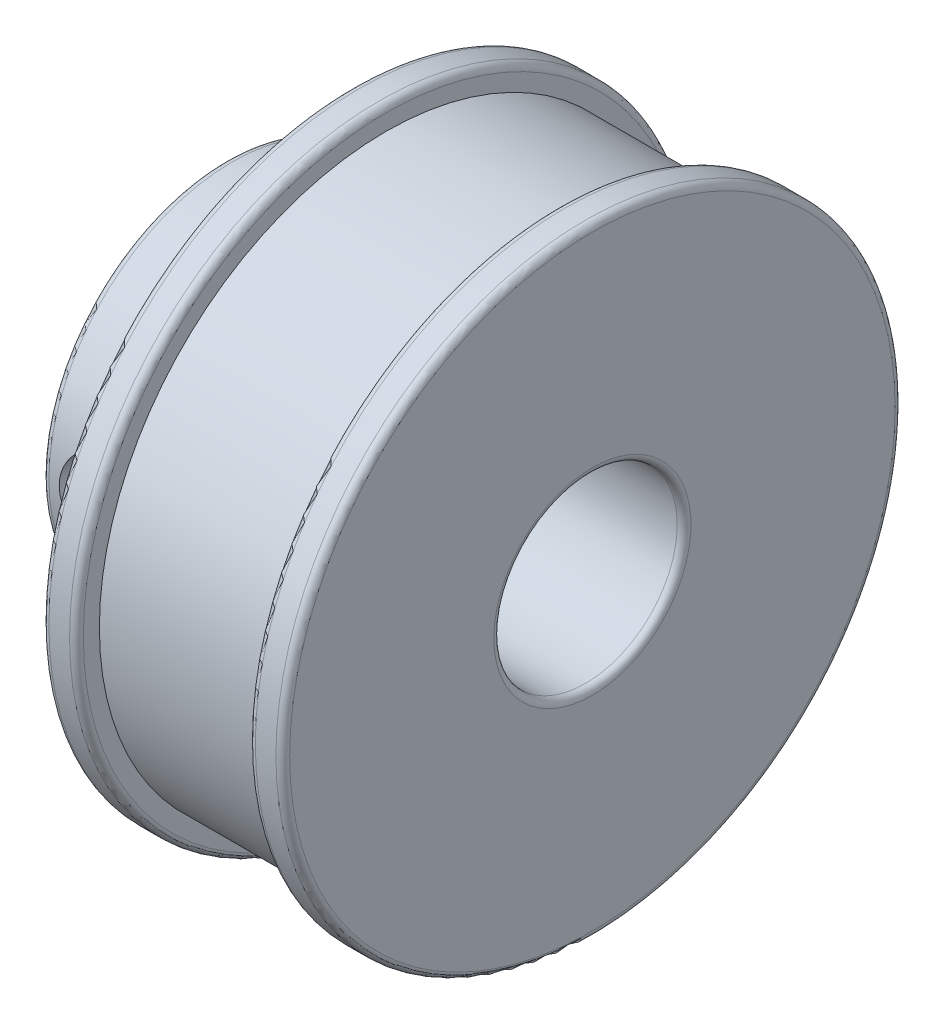
ISO-10303-21;
HEADER;
FILE_DESCRIPTION(('STEP AP214'),'2;1');
FILE_NAME('part.step','',(''),(''),'','','');
FILE_SCHEMA(('AUTOMOTIVE_DESIGN { 1 0 10303 214 1 1 1 1 }'));
ENDSEC;
DATA;
#1=APPLICATION_CONTEXT('core data for automotive mechanical design processes');
#2=APPLICATION_PROTOCOL_DEFINITION('international standard','automotive_design',2000,#1);
#3=PRODUCT_CONTEXT('',#1,'mechanical');
#4=PRODUCT('Part','Part','',(#3));
#5=PRODUCT_RELATED_PRODUCT_CATEGORY('part','',(#4));
#6=PRODUCT_DEFINITION_FORMATION('','',#4);
#7=PRODUCT_DEFINITION_CONTEXT('part definition',#1,'design');
#8=PRODUCT_DEFINITION('design','',#6,#7);
#9=PRODUCT_DEFINITION_SHAPE('','',#8);
#10=(LENGTH_UNIT() NAMED_UNIT(*) SI_UNIT(.MILLI.,.METRE.));
#11=(NAMED_UNIT(*) PLANE_ANGLE_UNIT() SI_UNIT($,.RADIAN.));
#12=(NAMED_UNIT(*) SI_UNIT($,.STERADIAN.) SOLID_ANGLE_UNIT());
#13=UNCERTAINTY_MEASURE_WITH_UNIT(LENGTH_MEASURE(1.E-05),#10,'distance_accuracy_value','');
#14=(GEOMETRIC_REPRESENTATION_CONTEXT(3) GLOBAL_UNCERTAINTY_ASSIGNED_CONTEXT((#13)) GLOBAL_UNIT_ASSIGNED_CONTEXT((#10,
#11,#12)) REPRESENTATION_CONTEXT('',''));
#15=CARTESIAN_POINT('',(0.,0.,0.));
#16=DIRECTION('',(0.,0.,1.));
#17=DIRECTION('',(1.,0.,0.));
#18=AXIS2_PLACEMENT_3D('',#15,#16,#17);
#19=CARTESIAN_POINT('',(0.,0.,0.));
#20=DIRECTION('',(-1.,0.,0.));
#21=DIRECTION('',(0.,0.,1.));
#22=AXIS2_PLACEMENT_3D('',#19,#20,#21);
#23=CYLINDRICAL_SURFACE('',#22,4.);
#24=CARTESIAN_POINT('',(4.75,0.,4.));
#25=CARTESIAN_POINT('',(4.74999339536562,0.105143925902467,3.99999426810083));
#26=CARTESIAN_POINT('',(4.74165985375789,0.210413199395125,3.99580982039513));
#27=CARTESIAN_POINT('',(4.70869423931693,0.417840470537792,3.97948312074314));
#28=CARTESIAN_POINT('',(4.68403121400437,0.519992173427259,3.96732575657839));
#29=CARTESIAN_POINT('',(4.61961238276674,0.717867089760898,3.93632558806751));
#30=CARTESIAN_POINT('',(4.57991523150407,0.813613605878293,3.91750878355075));
#31=CARTESIAN_POINT('',(4.48685875727003,0.996945233613198,3.87491553031523));
#32=CARTESIAN_POINT('',(4.43350051150227,1.08453098798012,3.85113947267051));
#33=CARTESIAN_POINT('',(4.31096550102943,1.25501563552382,3.79912516516124));
#34=CARTESIAN_POINT('',(4.24102704152072,1.33731042224422,3.77070398255074));
#35=CARTESIAN_POINT('',(4.08895704150593,1.48955888973396,3.71319940493486));
#36=CARTESIAN_POINT('',(4.00681629645512,1.55950316621354,3.68411552418069));
#37=CARTESIAN_POINT('',(3.82503330095324,1.69050400090056,3.62597902394695));
#38=CARTESIAN_POINT('',(3.72452780330818,1.75045067110327,3.59710373940264));
#39=CARTESIAN_POINT('',(3.51326532802757,1.85233645378139,3.54571957544641));
#40=CARTESIAN_POINT('',(3.4025157425545,1.89428842993267,3.52320615213979));
#41=CARTESIAN_POINT('',(3.18066978915616,1.95626488437718,3.48915734075617));
#42=CARTESIAN_POINT('',(3.06999109586521,1.97745171416088,3.47704543167427));
#43=CARTESIAN_POINT('',(2.84604232444105,2.00085398661769,3.46363779897055));
#44=CARTESIAN_POINT('',(2.73277491825769,2.00308817674615,3.46233138686576));
#45=CARTESIAN_POINT('',(2.52142795136926,1.98937457434459,3.47021860514497));
#46=CARTESIAN_POINT('',(2.4231519375539,1.97556911907364,3.47817527324027));
#47=CARTESIAN_POINT('',(2.23055618125392,1.93387969811387,3.50152457467701));
#48=CARTESIAN_POINT('',(2.13623770938937,1.9059912477953,3.51691957663553));
#49=CARTESIAN_POINT('',(1.95154173486868,1.83641956077201,3.55374952825482));
#50=CARTESIAN_POINT('',(1.86130720242842,1.79443013423199,3.57531681327997));
#51=CARTESIAN_POINT('',(1.68873141481998,1.69808337533601,3.62206808562807));
#52=CARTESIAN_POINT('',(1.60639372879982,1.64372048762494,3.64725369560381));
#53=CARTESIAN_POINT('',(1.44095749451355,1.51613210982558,3.70226315806572));
#54=CARTESIAN_POINT('',(1.35908625284769,1.44138891673856,3.73227020473492));
#55=CARTESIAN_POINT('',(1.2085291628182,1.27911115748275,3.79095246600815));
#56=CARTESIAN_POINT('',(1.13984961593223,1.19157051314857,3.81962703917602));
#57=CARTESIAN_POINT('',(1.01462867794055,1.0010330116637,3.87403974565928));
#58=CARTESIAN_POINT('',(0.958799055108519,0.897507183198818,3.89957968324015));
#59=CARTESIAN_POINT('',(0.865805941913981,0.680932430977594,3.94315762242485));
#60=CARTESIAN_POINT('',(0.828627629969667,0.567891152530552,3.96120157887106));
#61=CARTESIAN_POINT('',(0.777049192566646,0.345532983321405,3.98648667482871));
#62=CARTESIAN_POINT('',(0.761017528506437,0.236683061096652,3.9944987660262));
#63=CARTESIAN_POINT('',(0.747070537731025,0.0175591998987032,4.00146026918207));
#64=CARTESIAN_POINT('',(0.749146628721063,-0.0927140397398174,4.00041397442638));
#65=CARTESIAN_POINT('',(0.770413376837487,-0.302465943971974,3.9898238450687));
#66=CARTESIAN_POINT('',(0.788265065459988,-0.402118816099861,3.98094491376337));
#67=CARTESIAN_POINT('',(0.838476143790243,-0.596813784603883,3.95644342629681));
#68=CARTESIAN_POINT('',(0.870837132906987,-0.691855371382174,3.94082012668824));
#69=CARTESIAN_POINT('',(0.949996932866066,-0.877777216899146,3.90368502827176));
#70=CARTESIAN_POINT('',(0.997182100232574,-0.968460794011607,3.88201763539262));
#71=CARTESIAN_POINT('',(1.10421507129313,-1.14092272339854,3.83487948634835));
#72=CARTESIAN_POINT('',(1.16406826919079,-1.22269725955318,3.80940711133877));
#73=CARTESIAN_POINT('',(1.30152085066143,-1.38353537857843,3.75416442672396));
#74=CARTESIAN_POINT('',(1.38028573689029,-1.46154415563805,3.72421769686999));
#75=CARTESIAN_POINT('',(1.54985030255546,-1.60371264223771,3.6652478321764));
#76=CARTESIAN_POINT('',(1.64065823769584,-1.66786277142375,3.63622534800094));
#77=CARTESIAN_POINT('',(1.83728730834595,-1.78341582895804,3.58102384412979));
#78=CARTESIAN_POINT('',(1.94362253218896,-1.8340509916005,3.55505059178122));
#79=CARTESIAN_POINT('',(2.16502013514993,-1.91616565186941,3.5114814458827));
#80=CARTESIAN_POINT('',(2.28007105293378,-1.94766983173403,3.493874764435));
#81=CARTESIAN_POINT('',(2.50382044576941,-1.98772337493375,3.47123002051604));
#82=CARTESIAN_POINT('',(2.61206850687048,-1.9981859928109,3.4651476693013));
#83=CARTESIAN_POINT('',(2.82889413432905,-2.00137830875241,3.46330709283207));
#84=CARTESIAN_POINT('',(2.93747153747572,-1.99411569324648,3.4675443925278));
#85=CARTESIAN_POINT('',(3.14096700306687,-1.96385225118662,3.48475724102153));
#86=CARTESIAN_POINT('',(3.23620094028948,-1.94241662868607,3.49686188965317));
#87=CARTESIAN_POINT('',(3.42161623884873,-1.88635071644882,3.52742032375305));
#88=CARTESIAN_POINT('',(3.51179596418406,-1.85171618231984,3.54587615139337));
#89=CARTESIAN_POINT('',(3.69124970197307,-1.76763149060113,3.58857060729071));
#90=CARTESIAN_POINT('',(3.78005580365806,-1.7173422756314,3.61311444791841));
#91=CARTESIAN_POINT('',(3.94854907236252,-1.60430194327479,3.66470663269721));
#92=CARTESIAN_POINT('',(4.02823146104222,-1.54154434248312,3.69175627591221));
#93=CARTESIAN_POINT('',(4.18628396470935,-1.39640665332275,3.74924646316184));
#94=CARTESIAN_POINT('',(4.26331820470058,-1.31256884599452,3.77969966613256));
#95=CARTESIAN_POINT('',(4.40252596687054,-1.1323096124664,3.83755504519862));
#96=CARTESIAN_POINT('',(4.46469147893981,-1.0358814466104,3.8649555725239));
#97=CARTESIAN_POINT('',(4.57247272542414,-0.831863193565893,3.91396019133075));
#98=CARTESIAN_POINT('',(4.61796833847294,-0.724199007553463,3.93552192987866));
#99=CARTESIAN_POINT('',(4.68961633551482,-0.501484202276175,3.97002682597974));
#100=CARTESIAN_POINT('',(4.71582369361143,-0.386455599178201,3.98299446726136));
#101=CARTESIAN_POINT('',(4.73779482217148,-0.225203892981791,3.99390923826956));
#102=CARTESIAN_POINT('',(4.74236528173268,-0.18032375888313,3.99618730680502));
#103=CARTESIAN_POINT('',(4.74846933102817,-0.0903034636101834,3.99923393953631));
#104=CARTESIAN_POINT('',(4.75000283694042,-0.045163295293257,4.00000246206762));
#105=CARTESIAN_POINT('',(4.75,0.,4.));
#106=B_SPLINE_CURVE_WITH_KNOTS('',3,(#24,#25,#26,#27,#28,#29,#30,#31,#32,#33,#34,#35,#36,#37,
#38,#39,#40,#41,#42,#43,#44,#45,#46,#47,#48,#49,#50,#51,#52,#53,#54,#55,#56,#57,#58,#59,#60,#61,
#62,#63,#64,#65,#66,#67,#68,#69,#70,#71,#72,#73,#74,#75,#76,#77,#78,#79,#80,#81,#82,#83,#84,#85,
#86,#87,#88,#89,#90,#91,#92,#93,#94,#95,#96,#97,#98,#99,#100,#101,#102,#103,#104,#105),
.UNSPECIFIED.,.T.,.F.,(4,2,2,2,2,2,2,2,2,2,2,2,2,2,2,2,2,2,2,2,2,2,2,2,2,2,2,2,2,2,2,2,2,2,2,2,
2,2,2,2,4),(0.,0.315248514840585,0.631096299418396,0.945724310984597,1.26032752116314,
1.59396351743618,1.92785247530807,2.28763452861506,2.64715895796562,2.98516024280459,
3.32282714658041,3.62011424818641,3.91749607851357,4.22180480336975,4.52625042520444,
4.86929882667757,5.21251069197373,5.57166044428881,5.93052433824559,6.25966580942691,
6.58865129022952,6.89213813012244,7.19565843261863,7.50785712055797,7.82018901496679,
8.16319221288838,8.50643177230864,8.86629364323452,9.22569023890902,9.55058615006093,
9.87534119729357,10.1691586049771,10.463070575767,10.7767291356057,11.0905512228726,
11.4425048551434,11.7946476676249,12.1492802732705,12.502898172423,12.6383056026783,
12.7737167702213),.UNSPECIFIED.);
#107=CARTESIAN_POINT('',(4.75,0.,4.));
#108=VERTEX_POINT('',#107);
#109=EDGE_CURVE('E90',#108,#108,#106,.T.);
#110=ORIENTED_EDGE('',*,*,#109,.T.);
#111=EDGE_LOOP('',(#110));
#112=FACE_BOUND('',#111,.T.);
#113=CARTESIAN_POINT('',(4.75,0.,-4.));
#114=CARTESIAN_POINT('',(4.74999339536562,-0.105143925902467,-3.99999426810083));
#115=CARTESIAN_POINT('',(4.74165985375789,-0.210413199395125,-3.99580982039513));
#116=CARTESIAN_POINT('',(4.70869423931693,-0.417840470537792,-3.97948312074314));
#117=CARTESIAN_POINT('',(4.68403121400437,-0.519992173427259,-3.96732575657839));
#118=CARTESIAN_POINT('',(4.61961238276674,-0.717867089760898,-3.93632558806751));
#119=CARTESIAN_POINT('',(4.57991523150407,-0.813613605878293,-3.91750878355075));
#120=CARTESIAN_POINT('',(4.48685875727003,-0.996945233613198,-3.87491553031523));
#121=CARTESIAN_POINT('',(4.43350051150227,-1.08453098798012,-3.85113947267051));
#122=CARTESIAN_POINT('',(4.31096550102943,-1.25501563552382,-3.79912516516124));
#123=CARTESIAN_POINT('',(4.24102704152072,-1.33731042224422,-3.77070398255074));
#124=CARTESIAN_POINT('',(4.08895704150593,-1.48955888973396,-3.71319940493486));
#125=CARTESIAN_POINT('',(4.00681629645512,-1.55950316621354,-3.68411552418069));
#126=CARTESIAN_POINT('',(3.82503330095324,-1.69050400090056,-3.62597902394695));
#127=CARTESIAN_POINT('',(3.72452780330818,-1.75045067110327,-3.59710373940264));
#128=CARTESIAN_POINT('',(3.51326532802757,-1.85233645378139,-3.54571957544641));
#129=CARTESIAN_POINT('',(3.4025157425545,-1.89428842993267,-3.52320615213979));
#130=CARTESIAN_POINT('',(3.18066978915616,-1.95626488437718,-3.48915734075617));
#131=CARTESIAN_POINT('',(3.06999109586521,-1.97745171416088,-3.47704543167427));
#132=CARTESIAN_POINT('',(2.84604232444105,-2.00085398661769,-3.46363779897055));
#133=CARTESIAN_POINT('',(2.73277491825769,-2.00308817674615,-3.46233138686576));
#134=CARTESIAN_POINT('',(2.52142795136926,-1.98937457434459,-3.47021860514497));
#135=CARTESIAN_POINT('',(2.4231519375539,-1.97556911907364,-3.47817527324027));
#136=CARTESIAN_POINT('',(2.23055618125392,-1.93387969811387,-3.50152457467701));
#137=CARTESIAN_POINT('',(2.13623770938937,-1.9059912477953,-3.51691957663553));
#138=CARTESIAN_POINT('',(1.95154173486868,-1.83641956077201,-3.55374952825482));
#139=CARTESIAN_POINT('',(1.86130720242842,-1.79443013423199,-3.57531681327997));
#140=CARTESIAN_POINT('',(1.68873141481998,-1.69808337533601,-3.62206808562807));
#141=CARTESIAN_POINT('',(1.60639372879982,-1.64372048762494,-3.64725369560381));
#142=CARTESIAN_POINT('',(1.44095749451355,-1.51613210982558,-3.70226315806572));
#143=CARTESIAN_POINT('',(1.35908625284769,-1.44138891673856,-3.73227020473492));
#144=CARTESIAN_POINT('',(1.2085291628182,-1.27911115748275,-3.79095246600815));
#145=CARTESIAN_POINT('',(1.13984961593223,-1.19157051314857,-3.81962703917602));
#146=CARTESIAN_POINT('',(1.01462867794055,-1.0010330116637,-3.87403974565928));
#147=CARTESIAN_POINT('',(0.958799055108519,-0.897507183198818,-3.89957968324015));
#148=CARTESIAN_POINT('',(0.865805941913981,-0.680932430977594,-3.94315762242485));
#149=CARTESIAN_POINT('',(0.828627629969667,-0.567891152530552,-3.96120157887106));
#150=CARTESIAN_POINT('',(0.777049192566646,-0.345532983321405,-3.98648667482871));
#151=CARTESIAN_POINT('',(0.761017528506437,-0.236683061096652,-3.9944987660262));
#152=CARTESIAN_POINT('',(0.747070537731025,-0.0175591998987032,-4.00146026918207));
#153=CARTESIAN_POINT('',(0.749146628721063,0.0927140397398174,-4.00041397442638));
#154=CARTESIAN_POINT('',(0.770413376837487,0.302465943971974,-3.9898238450687));
#155=CARTESIAN_POINT('',(0.788265065459988,0.402118816099861,-3.98094491376337));
#156=CARTESIAN_POINT('',(0.838476143790243,0.596813784603883,-3.95644342629681));
#157=CARTESIAN_POINT('',(0.870837132906987,0.691855371382174,-3.94082012668824));
#158=CARTESIAN_POINT('',(0.949996932866066,0.877777216899146,-3.90368502827176));
#159=CARTESIAN_POINT('',(0.997182100232574,0.968460794011607,-3.88201763539262));
#160=CARTESIAN_POINT('',(1.10421507129313,1.14092272339854,-3.83487948634835));
#161=CARTESIAN_POINT('',(1.16406826919079,1.22269725955318,-3.80940711133877));
#162=CARTESIAN_POINT('',(1.30152085066143,1.38353537857843,-3.75416442672396));
#163=CARTESIAN_POINT('',(1.38028573689029,1.46154415563805,-3.72421769686999));
#164=CARTESIAN_POINT('',(1.54985030255546,1.60371264223771,-3.6652478321764));
#165=CARTESIAN_POINT('',(1.64065823769584,1.66786277142375,-3.63622534800094));
#166=CARTESIAN_POINT('',(1.83728730834595,1.78341582895804,-3.58102384412979));
#167=CARTESIAN_POINT('',(1.94362253218896,1.8340509916005,-3.55505059178122));
#168=CARTESIAN_POINT('',(2.16502013514993,1.91616565186941,-3.5114814458827));
#169=CARTESIAN_POINT('',(2.28007105293378,1.94766983173403,-3.493874764435));
#170=CARTESIAN_POINT('',(2.50382044576941,1.98772337493375,-3.47123002051604));
#171=CARTESIAN_POINT('',(2.61206850687048,1.9981859928109,-3.4651476693013));
#172=CARTESIAN_POINT('',(2.82889413432905,2.00137830875241,-3.46330709283207));
#173=CARTESIAN_POINT('',(2.93747153747572,1.99411569324648,-3.4675443925278));
#174=CARTESIAN_POINT('',(3.14096700306687,1.96385225118662,-3.48475724102153));
#175=CARTESIAN_POINT('',(3.23620094028948,1.94241662868607,-3.49686188965317));
#176=CARTESIAN_POINT('',(3.42161623884873,1.88635071644882,-3.52742032375305));
#177=CARTESIAN_POINT('',(3.51179596418406,1.85171618231984,-3.54587615139337));
#178=CARTESIAN_POINT('',(3.69124970197307,1.76763149060113,-3.58857060729071));
#179=CARTESIAN_POINT('',(3.78005580365806,1.7173422756314,-3.61311444791841));
#180=CARTESIAN_POINT('',(3.94854907236252,1.60430194327479,-3.66470663269721));
#181=CARTESIAN_POINT('',(4.02823146104222,1.54154434248312,-3.69175627591221));
#182=CARTESIAN_POINT('',(4.18628396470935,1.39640665332275,-3.74924646316184));
#183=CARTESIAN_POINT('',(4.26331820470058,1.31256884599452,-3.77969966613256));
#184=CARTESIAN_POINT('',(4.40252596687054,1.1323096124664,-3.83755504519862));
#185=CARTESIAN_POINT('',(4.46469147893981,1.0358814466104,-3.8649555725239));
#186=CARTESIAN_POINT('',(4.57247272542414,0.831863193565893,-3.91396019133075));
#187=CARTESIAN_POINT('',(4.61796833847294,0.724199007553463,-3.93552192987866));
#188=CARTESIAN_POINT('',(4.68961633551482,0.501484202276175,-3.97002682597974));
#189=CARTESIAN_POINT('',(4.71582369361143,0.386455599178201,-3.98299446726136));
#190=CARTESIAN_POINT('',(4.73779482217148,0.225203892981791,-3.99390923826956));
#191=CARTESIAN_POINT('',(4.74236528173268,0.18032375888313,-3.99618730680502));
#192=CARTESIAN_POINT('',(4.74846933102817,0.0903034636101834,-3.99923393953631));
#193=CARTESIAN_POINT('',(4.75000283694042,0.045163295293257,-4.00000246206762));
#194=CARTESIAN_POINT('',(4.75,0.,-4.));
#195=B_SPLINE_CURVE_WITH_KNOTS('',3,(#113,#114,#115,#116,#117,#118,#119,#120,#121,#122,#123,
#124,#125,#126,#127,#128,#129,#130,#131,#132,#133,#134,#135,#136,#137,#138,#139,#140,#141,#142,
#143,#144,#145,#146,#147,#148,#149,#150,#151,#152,#153,#154,#155,#156,#157,#158,#159,#160,#161,
#162,#163,#164,#165,#166,#167,#168,#169,#170,#171,#172,#173,#174,#175,#176,#177,#178,#179,#180,
#181,#182,#183,#184,#185,#186,#187,#188,#189,#190,#191,#192,#193,#194),.UNSPECIFIED.,.T.,.F.,(4,
2,2,2,2,2,2,2,2,2,2,2,2,2,2,2,2,2,2,2,2,2,2,2,2,2,2,2,2,2,2,2,2,2,2,2,2,2,2,2,4),(0.,
0.315248514840585,0.631096299418396,0.945724310984597,1.26032752116314,1.59396351743618,
1.92785247530807,2.28763452861506,2.64715895796562,2.98516024280459,3.32282714658041,
3.62011424818641,3.91749607851357,4.22180480336975,4.52625042520444,4.86929882667757,
5.21251069197373,5.57166044428881,5.93052433824559,6.25966580942691,6.58865129022952,
6.89213813012244,7.19565843261863,7.50785712055797,7.82018901496679,8.16319221288838,
8.50643177230864,8.86629364323452,9.22569023890902,9.55058615006093,9.87534119729357,
10.1691586049771,10.463070575767,10.7767291356057,11.0905512228726,11.4425048551434,
11.7946476676249,12.1492802732705,12.502898172423,12.6383056026783,12.7737167702213),.UNSPECIFIED.);
#196=CARTESIAN_POINT('',(4.75,0.,-4.));
#197=VERTEX_POINT('',#196);
#198=EDGE_CURVE('E83',#197,#197,#195,.T.);
#199=ORIENTED_EDGE('',*,*,#198,.T.);
#200=EDGE_LOOP('',(#199));
#201=FACE_BOUND('',#200,.T.);
#202=CARTESIAN_POINT('',(0.3,0.,0.));
#203=DIRECTION('',(1.,0.,0.));
#204=DIRECTION('',(0.,0.,-1.));
#205=AXIS2_PLACEMENT_3D('',#202,#203,#204);
#206=CIRCLE('',#205,4.);
#207=CARTESIAN_POINT('',(0.3,0.,-4.));
#208=VERTEX_POINT('',#207);
#209=EDGE_CURVE('E175',#208,#208,#206,.F.);
#210=ORIENTED_EDGE('',*,*,#209,.T.);
#211=EDGE_LOOP('',(#210));
#212=FACE_BOUND('',#211,.T.);
#213=CARTESIAN_POINT('',(15.7,0.,0.));
#214=DIRECTION('',(-1.,0.,0.));
#215=DIRECTION('',(0.,0.,1.));
#216=AXIS2_PLACEMENT_3D('',#213,#214,#215);
#217=CIRCLE('',#216,4.);
#218=CARTESIAN_POINT('',(15.7,0.,4.));
#219=VERTEX_POINT('',#218);
#220=EDGE_CURVE('E171',#219,#219,#217,.F.);
#221=ORIENTED_EDGE('',*,*,#220,.T.);
#222=EDGE_LOOP('',(#221));
#223=FACE_BOUND('',#222,.T.);
#224=ADVANCED_FACE('F37',(#112,#201,#212,#223),#23,.F.);
#225=CARTESIAN_POINT('',(0.,0.,-4.));
#226=DIRECTION('',(1.,0.,0.));
#227=DIRECTION('',(0.,0.,-1.));
#228=AXIS2_PLACEMENT_3D('',#225,#226,#227);
#229=PLANE('',#228);
#230=CARTESIAN_POINT('',(0.,0.,0.));
#231=DIRECTION('',(1.,0.,0.));
#232=DIRECTION('',(0.,0.,-1.));
#233=AXIS2_PLACEMENT_3D('',#230,#231,#232);
#234=CIRCLE('',#233,4.3);
#235=CARTESIAN_POINT('',(0.,0.,-4.3));
#236=VERTEX_POINT('',#235);
#237=EDGE_CURVE('E183',#236,#236,#234,.T.);
#238=ORIENTED_EDGE('',*,*,#237,.T.);
#239=EDGE_LOOP('',(#238));
#240=FACE_BOUND('',#239,.T.);
#241=CARTESIAN_POINT('',(0.,0.,0.));
#242=DIRECTION('',(1.,0.,0.));
#243=DIRECTION('',(0.,0.,-1.));
#244=AXIS2_PLACEMENT_3D('',#241,#242,#243);
#245=CIRCLE('',#244,7.7);
#246=CARTESIAN_POINT('',(0.,0.,-7.7));
#247=VERTEX_POINT('',#246);
#248=EDGE_CURVE('E179',#247,#247,#245,.F.);
#249=ORIENTED_EDGE('',*,*,#248,.T.);
#250=EDGE_LOOP('',(#249));
#251=FACE_BOUND('',#250,.T.);
#252=ADVANCED_FACE('F98',(#240,#251),#229,.F.);
#253=CARTESIAN_POINT('',(0.,0.,0.));
#254=DIRECTION('',(-1.,0.,0.));
#255=DIRECTION('',(0.,0.,1.));
#256=AXIS2_PLACEMENT_3D('',#253,#254,#255);
#257=CYLINDRICAL_SURFACE('',#256,8.);
#258=CARTESIAN_POINT('',(4.75,0.,8.));
#259=CARTESIAN_POINT('',(4.74999689901579,-0.110501451559641,7.9999981315735));
#260=CARTESIAN_POINT('',(4.74081126563495,-0.221037543774351,7.99768770842435));
#261=CARTESIAN_POINT('',(4.70436646492399,-0.438941765027377,7.98869485106526));
#262=CARTESIAN_POINT('',(4.67709705394953,-0.54630806249432,7.98200993893301));
#263=CARTESIAN_POINT('',(4.60541432871722,-0.754694496243436,7.96500835109376));
#264=CARTESIAN_POINT('',(4.56102160171297,-0.855722084573336,7.95469603789411));
#265=CARTESIAN_POINT('',(4.45642481327354,-1.04889617587257,7.93153791743495));
#266=CARTESIAN_POINT('',(4.39622021850804,-1.14104237913168,7.91869202472209));
#267=CARTESIAN_POINT('',(4.26039894712776,-1.31573590306789,7.89156551455591));
#268=CARTESIAN_POINT('',(4.18451790005459,-1.39807425341474,7.87726276197502));
#269=CARTESIAN_POINT('',(4.02006372678795,-1.54899856960443,7.84898160157248));
#270=CARTESIAN_POINT('',(3.93148916940408,-1.61758298259892,7.83500323053157));
#271=CARTESIAN_POINT('',(3.74253969768401,-1.74003539039863,7.80873034264225));
#272=CARTESIAN_POINT('',(3.64200902558836,-1.79366962123352,7.79646392619748));
#273=CARTESIAN_POINT('',(3.43300211778662,-1.88319587806766,7.77532659757355));
#274=CARTESIAN_POINT('',(3.32452715555731,-1.91909074058685,7.76645514259225));
#275=CARTESIAN_POINT('',(3.10500866906445,-1.97140644907302,7.7533396892843));
#276=CARTESIAN_POINT('',(2.99406013861601,-1.98820302444274,7.74900654662681));
#277=CARTESIAN_POINT('',(2.77084190800087,-2.00301570008855,7.74519149946122));
#278=CARTESIAN_POINT('',(2.65857242574382,-2.00103485575748,7.74570880570571));
#279=CARTESIAN_POINT('',(2.4387789230062,-1.97864869951961,7.75145607355756));
#280=CARTESIAN_POINT('',(2.33120583804623,-1.95869112025418,7.75657150676391));
#281=CARTESIAN_POINT('',(2.12098526545192,-1.90163224920399,7.77075612894758));
#282=CARTESIAN_POINT('',(2.01833812929477,-1.86452973609252,7.77982559958985));
#283=CARTESIAN_POINT('',(1.81968264499716,-1.77385263724958,7.80100151874212));
#284=CARTESIAN_POINT('',(1.72375177094724,-1.72011555631056,7.81313769959755));
#285=CARTESIAN_POINT('',(1.54210838699091,-1.59780836801993,7.83906281127988));
#286=CARTESIAN_POINT('',(1.45639766924367,-1.52923566507845,7.85285203112837));
#287=CARTESIAN_POINT('',(1.29506184574079,-1.37688456624163,7.88101174053188));
#288=CARTESIAN_POINT('',(1.21979401325153,-1.29272834422115,7.89538759304001));
#289=CARTESIAN_POINT('',(1.0843716767148,-1.11281589000493,7.92274620771675));
#290=CARTESIAN_POINT('',(1.02421763431525,-1.01705930361059,7.93572892732543));
#291=CARTESIAN_POINT('',(0.920599218367485,-0.816154518241856,7.9589030945892));
#292=CARTESIAN_POINT('',(0.877192879660763,-0.710975190944832,7.96908480170303));
#293=CARTESIAN_POINT('',(0.808776925720569,-0.494501344190511,7.98543889321888));
#294=CARTESIAN_POINT('',(0.783763791442482,-0.383207998867313,7.99161204452374));
#295=CARTESIAN_POINT('',(0.753389912588216,-0.160719960520036,7.999139990285));
#296=CARTESIAN_POINT('',(0.747542631899598,-0.0495956266509461,8.00061404677705));
#297=CARTESIAN_POINT('',(0.754332002740648,0.172043833068678,7.99891739752601));
#298=CARTESIAN_POINT('',(0.766966990398843,0.28255901285946,7.99574710989128));
#299=CARTESIAN_POINT('',(0.809961211188506,0.498152358368655,7.98519441503143));
#300=CARTESIAN_POINT('',(0.840055017969315,0.603286825291672,7.97787512247748));
#301=CARTESIAN_POINT('',(0.916809445371262,0.807009723270015,7.95984942178845));
#302=CARTESIAN_POINT('',(0.963471739084226,0.905597492043513,7.94914267159856));
#303=CARTESIAN_POINT('',(1.0729815051663,1.0953641792398,7.92524410568414));
#304=CARTESIAN_POINT('',(1.13610148319568,1.18638058911444,7.91201156489243));
#305=CARTESIAN_POINT('',(1.27638654506263,1.35670215152433,7.88459345583226));
#306=CARTESIAN_POINT('',(1.35355405282254,1.43600527863068,7.87040772335606));
#307=CARTESIAN_POINT('',(1.52200261445928,1.58265409076364,7.84225275947695));
#308=CARTESIAN_POINT('',(1.61358360400323,1.64965849016271,7.82829738916375));
#309=CARTESIAN_POINT('',(1.80697684595429,1.7673476786836,7.80257171169652));
#310=CARTESIAN_POINT('',(1.90878864394634,1.81803319221058,7.79080130756035));
#311=CARTESIAN_POINT('',(2.1192076298841,1.90126856081239,7.77090792979553));
#312=CARTESIAN_POINT('',(2.22777017112534,1.93392586220542,7.76276340389207));
#313=CARTESIAN_POINT('',(2.44907951718548,1.98046087993837,7.75102325453578));
#314=CARTESIAN_POINT('',(2.56182540137665,1.99434270330488,7.74742663626581));
#315=CARTESIAN_POINT('',(2.78482803180694,2.00271812044533,7.74526534938609));
#316=CARTESIAN_POINT('',(2.89506324683297,1.99775719704016,7.74655910304351));
#317=CARTESIAN_POINT('',(3.11307185155731,1.96983637108382,7.7537054534379));
#318=CARTESIAN_POINT('',(3.22084529068487,1.94687683024903,7.75955795855809));
#319=CARTESIAN_POINT('',(3.43027794542054,1.88390842592373,7.77508347576963));
#320=CARTESIAN_POINT('',(3.53196974032028,1.84400187290717,7.78473353648412));
#321=CARTESIAN_POINT('',(3.72728717695159,1.74835321814009,7.80677007633105));
#322=CARTESIAN_POINT('',(3.82091169758255,1.69260892004558,7.81915693494364));
#323=CARTESIAN_POINT('',(4.00007283866936,1.56515699818285,7.84567512351349));
#324=CARTESIAN_POINT('',(4.08533476456528,1.49307088388301,7.85984353109009));
#325=CARTESIAN_POINT('',(4.24272939306054,1.33571916158631,7.88810702995047));
#326=CARTESIAN_POINT('',(4.31485897348396,1.25045042834819,7.90220210302746));
#327=CARTESIAN_POINT('',(4.44521507808614,1.06729011560345,7.92903540863551));
#328=CARTESIAN_POINT('',(4.50316615156211,0.969197896421849,7.94174444487824));
#329=CARTESIAN_POINT('',(4.60166328392071,0.764354746013968,7.96406566633491));
#330=CARTESIAN_POINT('',(4.64222181419805,0.657610084582319,7.97368006933042));
#331=CARTESIAN_POINT('',(4.69876244043954,0.459213670991295,7.98730746087389));
#332=CARTESIAN_POINT('',(4.71793499073791,0.368506894544092,7.9920344673692));
#333=CARTESIAN_POINT('',(4.74355459149592,0.185208095381711,7.99838140309264));
#334=CARTESIAN_POINT('',(4.75000259907374,0.0926162149901552,8.00000156601192));
#335=CARTESIAN_POINT('',(4.75,0.,8.));
#336=B_SPLINE_CURVE_WITH_KNOTS('',3,(#258,#259,#260,#261,#262,#263,#264,#265,#266,#267,#268,
#269,#270,#271,#272,#273,#274,#275,#276,#277,#278,#279,#280,#281,#282,#283,#284,#285,#286,#287,
#288,#289,#290,#291,#292,#293,#294,#295,#296,#297,#298,#299,#300,#301,#302,#303,#304,#305,#306,
#307,#308,#309,#310,#311,#312,#313,#314,#315,#316,#317,#318,#319,#320,#321,#322,#323,#324,#325,
#326,#327,#328,#329,#330,#331,#332,#333,#334,#335),.UNSPECIFIED.,.T.,.F.,(4,2,2,2,2,2,2,2,2,2,2,
2,2,2,2,2,2,2,2,2,2,2,2,2,2,2,2,2,2,2,2,2,2,2,2,2,2,2,4),(0.,0.33116494996252,0.662517650351866,
0.993473203048141,1.32443992022577,1.66152580582852,1.99864972773416,2.34078196727743,
2.68285948225825,3.01808393468093,3.3532538415469,3.68029996013785,4.00736937959146,
4.337740371696,4.66816921119311,5.00802001296454,5.34788119415424,5.6889097201658,
6.02987298255951,6.36211078603463,6.69431868154752,7.02160366023144,7.34892169767482,
7.68204783424897,8.01523150681786,8.35659345610396,8.69794025003772,9.03723006156476,
9.37644564340972,9.70591707202578,10.0353818794581,10.3628853408369,10.6904342418696,
11.0265276855097,11.3627009303165,11.7049624733721,12.0469781843289,12.3245632392729,
12.6021274139515),.UNSPECIFIED.);
#337=CARTESIAN_POINT('',(4.75,0.,8.));
#338=VERTEX_POINT('',#337);
#339=EDGE_CURVE('E41',#338,#338,#336,.T.);
#340=ORIENTED_EDGE('',*,*,#339,.T.);
#341=EDGE_LOOP('',(#340));
#342=FACE_BOUND('',#341,.T.);
#343=CARTESIAN_POINT('',(4.75,0.,-8.));
#344=CARTESIAN_POINT('',(4.74999689901579,0.110501451559641,-7.9999981315735));
#345=CARTESIAN_POINT('',(4.74081126563495,0.221037543774351,-7.99768770842435));
#346=CARTESIAN_POINT('',(4.70436646492399,0.438941765027377,-7.98869485106526));
#347=CARTESIAN_POINT('',(4.67709705394953,0.54630806249432,-7.98200993893301));
#348=CARTESIAN_POINT('',(4.60541432871722,0.754694496243436,-7.96500835109376));
#349=CARTESIAN_POINT('',(4.56102160171297,0.855722084573336,-7.95469603789411));
#350=CARTESIAN_POINT('',(4.45642481327354,1.04889617587257,-7.93153791743495));
#351=CARTESIAN_POINT('',(4.39622021850804,1.14104237913168,-7.91869202472209));
#352=CARTESIAN_POINT('',(4.26039894712776,1.31573590306789,-7.89156551455591));
#353=CARTESIAN_POINT('',(4.18451790005459,1.39807425341474,-7.87726276197502));
#354=CARTESIAN_POINT('',(4.02006372678795,1.54899856960443,-7.84898160157248));
#355=CARTESIAN_POINT('',(3.93148916940408,1.61758298259892,-7.83500323053157));
#356=CARTESIAN_POINT('',(3.74253969768401,1.74003539039863,-7.80873034264225));
#357=CARTESIAN_POINT('',(3.64200902558836,1.79366962123352,-7.79646392619748));
#358=CARTESIAN_POINT('',(3.43300211778662,1.88319587806766,-7.77532659757355));
#359=CARTESIAN_POINT('',(3.32452715555731,1.91909074058685,-7.76645514259225));
#360=CARTESIAN_POINT('',(3.10500866906445,1.97140644907302,-7.7533396892843));
#361=CARTESIAN_POINT('',(2.99406013861601,1.98820302444274,-7.74900654662681));
#362=CARTESIAN_POINT('',(2.77084190800087,2.00301570008855,-7.74519149946122));
#363=CARTESIAN_POINT('',(2.65857242574382,2.00103485575748,-7.74570880570571));
#364=CARTESIAN_POINT('',(2.4387789230062,1.97864869951961,-7.75145607355756));
#365=CARTESIAN_POINT('',(2.33120583804623,1.95869112025418,-7.75657150676391));
#366=CARTESIAN_POINT('',(2.12098526545192,1.90163224920399,-7.77075612894758));
#367=CARTESIAN_POINT('',(2.01833812929477,1.86452973609252,-7.77982559958985));
#368=CARTESIAN_POINT('',(1.81968264499716,1.77385263724958,-7.80100151874212));
#369=CARTESIAN_POINT('',(1.72375177094724,1.72011555631056,-7.81313769959755));
#370=CARTESIAN_POINT('',(1.54210838699091,1.59780836801993,-7.83906281127988));
#371=CARTESIAN_POINT('',(1.45639766924367,1.52923566507845,-7.85285203112837));
#372=CARTESIAN_POINT('',(1.29506184574079,1.37688456624163,-7.88101174053188));
#373=CARTESIAN_POINT('',(1.21979401325153,1.29272834422115,-7.89538759304001));
#374=CARTESIAN_POINT('',(1.0843716767148,1.11281589000493,-7.92274620771675));
#375=CARTESIAN_POINT('',(1.02421763431525,1.01705930361059,-7.93572892732543));
#376=CARTESIAN_POINT('',(0.920599218367485,0.816154518241856,-7.9589030945892));
#377=CARTESIAN_POINT('',(0.877192879660763,0.710975190944832,-7.96908480170303));
#378=CARTESIAN_POINT('',(0.808776925720569,0.494501344190511,-7.98543889321888));
#379=CARTESIAN_POINT('',(0.783763791442482,0.383207998867313,-7.99161204452374));
#380=CARTESIAN_POINT('',(0.753389912588216,0.160719960520036,-7.999139990285));
#381=CARTESIAN_POINT('',(0.747542631899598,0.0495956266509461,-8.00061404677705));
#382=CARTESIAN_POINT('',(0.754332002740648,-0.172043833068678,-7.99891739752601));
#383=CARTESIAN_POINT('',(0.766966990398843,-0.28255901285946,-7.99574710989128));
#384=CARTESIAN_POINT('',(0.809961211188506,-0.498152358368655,-7.98519441503143));
#385=CARTESIAN_POINT('',(0.840055017969315,-0.603286825291672,-7.97787512247748));
#386=CARTESIAN_POINT('',(0.916809445371262,-0.807009723270015,-7.95984942178845));
#387=CARTESIAN_POINT('',(0.963471739084226,-0.905597492043513,-7.94914267159856));
#388=CARTESIAN_POINT('',(1.0729815051663,-1.0953641792398,-7.92524410568414));
#389=CARTESIAN_POINT('',(1.13610148319568,-1.18638058911444,-7.91201156489243));
#390=CARTESIAN_POINT('',(1.27638654506263,-1.35670215152433,-7.88459345583226));
#391=CARTESIAN_POINT('',(1.35355405282254,-1.43600527863068,-7.87040772335606));
#392=CARTESIAN_POINT('',(1.52200261445928,-1.58265409076364,-7.84225275947695));
#393=CARTESIAN_POINT('',(1.61358360400323,-1.64965849016271,-7.82829738916375));
#394=CARTESIAN_POINT('',(1.80697684595429,-1.7673476786836,-7.80257171169652));
#395=CARTESIAN_POINT('',(1.90878864394634,-1.81803319221058,-7.79080130756035));
#396=CARTESIAN_POINT('',(2.1192076298841,-1.90126856081239,-7.77090792979553));
#397=CARTESIAN_POINT('',(2.22777017112534,-1.93392586220542,-7.76276340389207));
#398=CARTESIAN_POINT('',(2.44907951718548,-1.98046087993837,-7.75102325453578));
#399=CARTESIAN_POINT('',(2.56182540137665,-1.99434270330488,-7.74742663626581));
#400=CARTESIAN_POINT('',(2.78482803180694,-2.00271812044533,-7.74526534938609));
#401=CARTESIAN_POINT('',(2.89506324683297,-1.99775719704016,-7.74655910304351));
#402=CARTESIAN_POINT('',(3.11307185155731,-1.96983637108382,-7.7537054534379));
#403=CARTESIAN_POINT('',(3.22084529068487,-1.94687683024903,-7.75955795855809));
#404=CARTESIAN_POINT('',(3.43027794542054,-1.88390842592373,-7.77508347576963));
#405=CARTESIAN_POINT('',(3.53196974032028,-1.84400187290717,-7.78473353648412));
#406=CARTESIAN_POINT('',(3.72728717695159,-1.74835321814009,-7.80677007633105));
#407=CARTESIAN_POINT('',(3.82091169758255,-1.69260892004558,-7.81915693494364));
#408=CARTESIAN_POINT('',(4.00007283866936,-1.56515699818285,-7.84567512351349));
#409=CARTESIAN_POINT('',(4.08533476456528,-1.49307088388301,-7.85984353109009));
#410=CARTESIAN_POINT('',(4.24272939306054,-1.33571916158631,-7.88810702995047));
#411=CARTESIAN_POINT('',(4.31485897348396,-1.25045042834819,-7.90220210302746));
#412=CARTESIAN_POINT('',(4.44521507808614,-1.06729011560345,-7.92903540863551));
#413=CARTESIAN_POINT('',(4.50316615156211,-0.969197896421849,-7.94174444487824));
#414=CARTESIAN_POINT('',(4.60166328392071,-0.764354746013968,-7.96406566633491));
#415=CARTESIAN_POINT('',(4.64222181419805,-0.657610084582319,-7.97368006933042));
#416=CARTESIAN_POINT('',(4.69876244043954,-0.459213670991295,-7.98730746087389));
#417=CARTESIAN_POINT('',(4.71793499073791,-0.368506894544092,-7.9920344673692));
#418=CARTESIAN_POINT('',(4.74355459149592,-0.185208095381711,-7.99838140309264));
#419=CARTESIAN_POINT('',(4.75000259907374,-0.0926162149901552,-8.00000156601192));
#420=CARTESIAN_POINT('',(4.75,0.,-8.));
#421=B_SPLINE_CURVE_WITH_KNOTS('',3,(#343,#344,#345,#346,#347,#348,#349,#350,#351,#352,#353,
#354,#355,#356,#357,#358,#359,#360,#361,#362,#363,#364,#365,#366,#367,#368,#369,#370,#371,#372,
#373,#374,#375,#376,#377,#378,#379,#380,#381,#382,#383,#384,#385,#386,#387,#388,#389,#390,#391,
#392,#393,#394,#395,#396,#397,#398,#399,#400,#401,#402,#403,#404,#405,#406,#407,#408,#409,#410,
#411,#412,#413,#414,#415,#416,#417,#418,#419,#420),.UNSPECIFIED.,.T.,.F.,(4,2,2,2,2,2,2,2,2,2,2,
2,2,2,2,2,2,2,2,2,2,2,2,2,2,2,2,2,2,2,2,2,2,2,2,2,2,2,4),(0.,0.33116494996252,0.662517650351866,
0.993473203048141,1.32443992022577,1.66152580582852,1.99864972773416,2.34078196727743,
2.68285948225825,3.01808393468093,3.3532538415469,3.68029996013785,4.00736937959146,
4.337740371696,4.66816921119311,5.00802001296454,5.34788119415424,5.6889097201658,
6.02987298255951,6.36211078603463,6.69431868154752,7.02160366023144,7.34892169767482,
7.68204783424897,8.01523150681786,8.35659345610396,8.69794025003772,9.03723006156476,
9.37644564340972,9.70591707202578,10.0353818794581,10.3628853408369,10.6904342418696,
11.0265276855097,11.3627009303165,11.7049624733721,12.0469781843289,12.3245632392729,
12.6021274139515),.UNSPECIFIED.);
#422=CARTESIAN_POINT('',(4.75,0.,-8.));
#423=VERTEX_POINT('',#422);
#424=EDGE_CURVE('E60',#423,#423,#421,.T.);
#425=ORIENTED_EDGE('',*,*,#424,.T.);
#426=EDGE_LOOP('',(#425));
#427=FACE_BOUND('',#426,.T.);
#428=CARTESIAN_POINT('',(0.3,0.,0.));
#429=DIRECTION('',(1.,0.,0.));
#430=DIRECTION('',(0.,0.,-1.));
#431=AXIS2_PLACEMENT_3D('',#428,#429,#430);
#432=CIRCLE('',#431,8.);
#433=CARTESIAN_POINT('',(0.3,0.,-8.));
#434=VERTEX_POINT('',#433);
#435=EDGE_CURVE('E10',#434,#434,#432,.T.);
#436=ORIENTED_EDGE('',*,*,#435,.T.);
#437=EDGE_LOOP('',(#436));
#438=FACE_BOUND('',#437,.T.);
#439=CARTESIAN_POINT('',(5.5,0.,0.));
#440=DIRECTION('',(-1.,0.,0.));
#441=DIRECTION('',(0.,0.,1.));
#442=AXIS2_PLACEMENT_3D('',#439,#440,#441);
#443=CIRCLE('',#442,8.);
#444=CARTESIAN_POINT('',(5.5,0.,8.));
#445=VERTEX_POINT('',#444);
#446=EDGE_CURVE('E148',#445,#445,#443,.T.);
#447=ORIENTED_EDGE('',*,*,#446,.T.);
#448=EDGE_LOOP('',(#447));
#449=FACE_BOUND('',#448,.T.);
#450=ADVANCED_FACE('F66',(#342,#427,#438,#449),#257,.T.);
#451=CARTESIAN_POINT('',(5.5,0.,-13.5));
#452=DIRECTION('',(1.,0.,0.));
#453=DIRECTION('',(0.,0.,-1.));
#454=AXIS2_PLACEMENT_3D('',#451,#452,#453);
#455=PLANE('',#454);
#456=CARTESIAN_POINT('',(5.5,0.,0.));
#457=DIRECTION('',(1.,0.,0.));
#458=DIRECTION('',(0.,0.,-1.));
#459=AXIS2_PLACEMENT_3D('',#456,#457,#458);
#460=CIRCLE('',#459,13.2);
#461=CARTESIAN_POINT('',(5.5,0.,-13.2));
#462=VERTEX_POINT('',#461);
#463=EDGE_CURVE('E167',#462,#462,#460,.F.);
#464=ORIENTED_EDGE('',*,*,#463,.T.);
#465=EDGE_LOOP('',(#464));
#466=FACE_BOUND('',#465,.T.);
#467=ORIENTED_EDGE('',*,*,#446,.F.);
#468=EDGE_LOOP('',(#467));
#469=FACE_BOUND('',#468,.T.);
#470=ADVANCED_FACE('F217',(#466,#469),#455,.F.);
#471=CARTESIAN_POINT('',(0.,0.,0.));
#472=DIRECTION('',(-1.,0.,0.));
#473=DIRECTION('',(0.,0.,1.));
#474=AXIS2_PLACEMENT_3D('',#471,#472,#473);
#475=CYLINDRICAL_SURFACE('',#474,13.5);
#476=CARTESIAN_POINT('',(6.7,0.,0.));
#477=DIRECTION('',(-1.,0.,0.));
#478=DIRECTION('',(0.,0.,1.));
#479=AXIS2_PLACEMENT_3D('',#476,#477,#478);
#480=CIRCLE('',#479,13.5);
#481=CARTESIAN_POINT('',(6.7,0.,13.5));
#482=VERTEX_POINT('',#481);
#483=EDGE_CURVE('E159',#482,#482,#480,.T.);
#484=ORIENTED_EDGE('',*,*,#483,.T.);
#485=EDGE_LOOP('',(#484));
#486=FACE_BOUND('',#485,.T.);
#487=CARTESIAN_POINT('',(5.8,0.,0.));
#488=DIRECTION('',(1.,0.,0.));
#489=DIRECTION('',(0.,0.,-1.));
#490=AXIS2_PLACEMENT_3D('',#487,#488,#489);
#491=CIRCLE('',#490,13.5);
#492=CARTESIAN_POINT('',(5.8,0.,-13.5));
#493=VERTEX_POINT('',#492);
#494=EDGE_CURVE('E155',#493,#493,#491,.T.);
#495=ORIENTED_EDGE('',*,*,#494,.T.);
#496=EDGE_LOOP('',(#495));
#497=FACE_BOUND('',#496,.T.);
#498=ADVANCED_FACE('F214',(#486,#497),#475,.T.);
#499=CARTESIAN_POINT('',(7.,0.,-13.5));
#500=DIRECTION('',(-1.,0.,0.));
#501=DIRECTION('',(0.,0.,1.));
#502=AXIS2_PLACEMENT_3D('',#499,#500,#501);
#503=PLANE('',#502);
#504=CARTESIAN_POINT('',(7.,0.,0.));
#505=DIRECTION('',(-1.,0.,0.));
#506=DIRECTION('',(0.,0.,1.));
#507=AXIS2_PLACEMENT_3D('',#504,#505,#506);
#508=CIRCLE('',#507,13.2);
#509=CARTESIAN_POINT('',(7.,0.,13.2));
#510=VERTEX_POINT('',#509);
#511=EDGE_CURVE('E163',#510,#510,#508,.F.);
#512=ORIENTED_EDGE('',*,*,#511,.T.);
#513=EDGE_LOOP('',(#512));
#514=FACE_BOUND('',#513,.T.);
#515=CARTESIAN_POINT('',(7.,0.,0.));
#516=DIRECTION('',(-1.,0.,0.));
#517=DIRECTION('',(0.,0.,1.));
#518=AXIS2_PLACEMENT_3D('',#515,#516,#517);
#519=CIRCLE('',#518,12.5);
#520=CARTESIAN_POINT('',(7.,0.,12.5));
#521=VERTEX_POINT('',#520);
#522=EDGE_CURVE('E144',#521,#521,#519,.T.);
#523=ORIENTED_EDGE('',*,*,#522,.T.);
#524=EDGE_LOOP('',(#523));
#525=FACE_BOUND('',#524,.T.);
#526=ADVANCED_FACE('F210',(#514,#525),#503,.F.);
#527=CARTESIAN_POINT('',(0.,0.,0.));
#528=DIRECTION('',(-1.,0.,0.));
#529=DIRECTION('',(0.,0.,1.));
#530=AXIS2_PLACEMENT_3D('',#527,#528,#529);
#531=CYLINDRICAL_SURFACE('',#530,12.5);
#532=ORIENTED_EDGE('',*,*,#522,.F.);
#533=EDGE_LOOP('',(#532));
#534=FACE_BOUND('',#533,.T.);
#535=CARTESIAN_POINT('',(14.5,0.,0.));
#536=DIRECTION('',(-1.,0.,0.));
#537=DIRECTION('',(0.,0.,1.));
#538=AXIS2_PLACEMENT_3D('',#535,#536,#537);
#539=CIRCLE('',#538,12.5);
#540=CARTESIAN_POINT('',(14.5,0.,12.5));
#541=VERTEX_POINT('',#540);
#542=EDGE_CURVE('E141',#541,#541,#539,.T.);
#543=ORIENTED_EDGE('',*,*,#542,.T.);
#544=EDGE_LOOP('',(#543));
#545=FACE_BOUND('',#544,.T.);
#546=ADVANCED_FACE('F137',(#534,#545),#531,.T.);
#547=CARTESIAN_POINT('',(14.5,0.,-12.5));
#548=DIRECTION('',(1.,0.,0.));
#549=DIRECTION('',(0.,0.,-1.));
#550=AXIS2_PLACEMENT_3D('',#547,#548,#549);
#551=PLANE('',#550);
#552=CARTESIAN_POINT('',(14.5,0.,0.));
#553=DIRECTION('',(1.,0.,0.));
#554=DIRECTION('',(0.,0.,-1.));
#555=AXIS2_PLACEMENT_3D('',#552,#553,#554);
#556=CIRCLE('',#555,13.2);
#557=CARTESIAN_POINT('',(14.5,0.,-13.2));
#558=VERTEX_POINT('',#557);
#559=EDGE_CURVE('E51',#558,#558,#556,.F.);
#560=ORIENTED_EDGE('',*,*,#559,.T.);
#561=EDGE_LOOP('',(#560));
#562=FACE_BOUND('',#561,.T.);
#563=ORIENTED_EDGE('',*,*,#542,.F.);
#564=EDGE_LOOP('',(#563));
#565=FACE_BOUND('',#564,.T.);
#566=ADVANCED_FACE('F133',(#562,#565),#551,.F.);
#567=CARTESIAN_POINT('',(0.,0.,0.));
#568=DIRECTION('',(-1.,0.,0.));
#569=DIRECTION('',(0.,0.,1.));
#570=AXIS2_PLACEMENT_3D('',#567,#568,#569);
#571=CYLINDRICAL_SURFACE('',#570,13.5);
#572=CARTESIAN_POINT('',(15.7,0.,0.));
#573=DIRECTION('',(-1.,0.,0.));
#574=DIRECTION('',(0.,0.,1.));
#575=AXIS2_PLACEMENT_3D('',#572,#573,#574);
#576=CIRCLE('',#575,13.5);
#577=CARTESIAN_POINT('',(15.7,0.,13.5));
#578=VERTEX_POINT('',#577);
#579=EDGE_CURVE('E57',#578,#578,#576,.T.);
#580=ORIENTED_EDGE('',*,*,#579,.T.);
#581=EDGE_LOOP('',(#580));
#582=FACE_BOUND('',#581,.T.);
#583=CARTESIAN_POINT('',(14.8,0.,0.));
#584=DIRECTION('',(1.,0.,0.));
#585=DIRECTION('',(0.,0.,-1.));
#586=AXIS2_PLACEMENT_3D('',#583,#584,#585);
#587=CIRCLE('',#586,13.5);
#588=CARTESIAN_POINT('',(14.8,0.,-13.5));
#589=VERTEX_POINT('',#588);
#590=EDGE_CURVE('E130',#589,#589,#587,.T.);
#591=ORIENTED_EDGE('',*,*,#590,.T.);
#592=EDGE_LOOP('',(#591));
#593=FACE_BOUND('',#592,.T.);
#594=ADVANCED_FACE('F136',(#582,#593),#571,.T.);
#595=CARTESIAN_POINT('',(16.,0.,-13.5));
#596=DIRECTION('',(-1.,0.,0.));
#597=DIRECTION('',(0.,0.,1.));
#598=AXIS2_PLACEMENT_3D('',#595,#596,#597);
#599=PLANE('',#598);
#600=CARTESIAN_POINT('',(16.,0.,0.));
#601=DIRECTION('',(-1.,0.,0.));
#602=DIRECTION('',(0.,0.,1.));
#603=AXIS2_PLACEMENT_3D('',#600,#601,#602);
#604=CIRCLE('',#603,4.3);
#605=CARTESIAN_POINT('',(16.,0.,4.3));
#606=VERTEX_POINT('',#605);
#607=EDGE_CURVE('E191',#606,#606,#604,.T.);
#608=ORIENTED_EDGE('',*,*,#607,.T.);
#609=EDGE_LOOP('',(#608));
#610=FACE_BOUND('',#609,.T.);
#611=CARTESIAN_POINT('',(16.,0.,0.));
#612=DIRECTION('',(-1.,0.,0.));
#613=DIRECTION('',(0.,0.,1.));
#614=AXIS2_PLACEMENT_3D('',#611,#612,#613);
#615=CIRCLE('',#614,13.2);
#616=CARTESIAN_POINT('',(16.,0.,13.2));
#617=VERTEX_POINT('',#616);
#618=EDGE_CURVE('E187',#617,#617,#615,.F.);
#619=ORIENTED_EDGE('',*,*,#618,.T.);
#620=EDGE_LOOP('',(#619));
#621=FACE_BOUND('',#620,.T.);
#622=ADVANCED_FACE('F76',(#610,#621),#599,.F.);
#623=CARTESIAN_POINT('',(6.7,0.,0.));
#624=DIRECTION('',(-1.,0.,0.));
#625=DIRECTION('',(0.,0.,1.));
#626=AXIS2_PLACEMENT_3D('',#623,#624,#625);
#627=TOROIDAL_SURFACE('',#626,13.2,0.3);
#628=ORIENTED_EDGE('',*,*,#511,.F.);
#629=EDGE_LOOP('',(#628));
#630=FACE_BOUND('',#629,.T.);
#631=ORIENTED_EDGE('',*,*,#483,.F.);
#632=EDGE_LOOP('',(#631));
#633=FACE_BOUND('',#632,.T.);
#634=ADVANCED_FACE('F100',(#630,#633),#627,.T.);
#635=CARTESIAN_POINT('',(5.8,0.,0.));
#636=DIRECTION('',(1.,0.,0.));
#637=DIRECTION('',(0.,0.,-1.));
#638=AXIS2_PLACEMENT_3D('',#635,#636,#637);
#639=TOROIDAL_SURFACE('',#638,13.2,0.3);
#640=ORIENTED_EDGE('',*,*,#494,.F.);
#641=EDGE_LOOP('',(#640));
#642=FACE_BOUND('',#641,.T.);
#643=ORIENTED_EDGE('',*,*,#463,.F.);
#644=EDGE_LOOP('',(#643));
#645=FACE_BOUND('',#644,.T.);
#646=ADVANCED_FACE('F104',(#642,#645),#639,.T.);
#647=CARTESIAN_POINT('',(0.3,0.,0.));
#648=DIRECTION('',(1.,0.,0.));
#649=DIRECTION('',(0.,0.,-1.));
#650=AXIS2_PLACEMENT_3D('',#647,#648,#649);
#651=TOROIDAL_SURFACE('',#650,4.3,0.3);
#652=ORIENTED_EDGE('',*,*,#237,.F.);
#653=EDGE_LOOP('',(#652));
#654=FACE_BOUND('',#653,.T.);
#655=ORIENTED_EDGE('',*,*,#209,.F.);
#656=EDGE_LOOP('',(#655));
#657=FACE_BOUND('',#656,.T.);
#658=ADVANCED_FACE('F108',(#654,#657),#651,.T.);
#659=CARTESIAN_POINT('',(15.7,0.,0.));
#660=DIRECTION('',(-1.,0.,0.));
#661=DIRECTION('',(0.,0.,1.));
#662=AXIS2_PLACEMENT_3D('',#659,#660,#661);
#663=TOROIDAL_SURFACE('',#662,4.3,0.3);
#664=ORIENTED_EDGE('',*,*,#220,.F.);
#665=EDGE_LOOP('',(#664));
#666=FACE_BOUND('',#665,.T.);
#667=ORIENTED_EDGE('',*,*,#607,.F.);
#668=EDGE_LOOP('',(#667));
#669=FACE_BOUND('',#668,.T.);
#670=ADVANCED_FACE('F112',(#666,#669),#663,.T.);
#671=CARTESIAN_POINT('',(15.7,0.,0.));
#672=DIRECTION('',(-1.,0.,0.));
#673=DIRECTION('',(0.,0.,1.));
#674=AXIS2_PLACEMENT_3D('',#671,#672,#673);
#675=TOROIDAL_SURFACE('',#674,13.2,0.3);
#676=ORIENTED_EDGE('',*,*,#618,.F.);
#677=EDGE_LOOP('',(#676));
#678=FACE_BOUND('',#677,.T.);
#679=ORIENTED_EDGE('',*,*,#579,.F.);
#680=EDGE_LOOP('',(#679));
#681=FACE_BOUND('',#680,.T.);
#682=ADVANCED_FACE('F116',(#678,#681),#675,.T.);
#683=CARTESIAN_POINT('',(14.8,0.,0.));
#684=DIRECTION('',(1.,0.,0.));
#685=DIRECTION('',(0.,0.,-1.));
#686=AXIS2_PLACEMENT_3D('',#683,#684,#685);
#687=TOROIDAL_SURFACE('',#686,13.2,0.3);
#688=ORIENTED_EDGE('',*,*,#590,.F.);
#689=EDGE_LOOP('',(#688));
#690=FACE_BOUND('',#689,.T.);
#691=ORIENTED_EDGE('',*,*,#559,.F.);
#692=EDGE_LOOP('',(#691));
#693=FACE_BOUND('',#692,.T.);
#694=ADVANCED_FACE('F119',(#690,#693),#687,.T.);
#695=CARTESIAN_POINT('',(0.3,0.,0.));
#696=DIRECTION('',(1.,0.,0.));
#697=DIRECTION('',(0.,0.,-1.));
#698=AXIS2_PLACEMENT_3D('',#695,#696,#697);
#699=TOROIDAL_SURFACE('',#698,7.7,0.3);
#700=ORIENTED_EDGE('',*,*,#435,.F.);
#701=EDGE_LOOP('',(#700));
#702=FACE_BOUND('',#701,.T.);
#703=ORIENTED_EDGE('',*,*,#248,.F.);
#704=EDGE_LOOP('',(#703));
#705=FACE_BOUND('',#704,.T.);
#706=ADVANCED_FACE('F39',(#702,#705),#699,.T.);
#707=CARTESIAN_POINT('',(2.75,0.,-13.5));
#708=DIRECTION('',(0.,0.,1.));
#709=DIRECTION('',(1.,0.,0.));
#710=AXIS2_PLACEMENT_3D('',#707,#708,#709);
#711=CYLINDRICAL_SURFACE('',#710,2.);
#712=ORIENTED_EDGE('',*,*,#424,.F.);
#713=EDGE_LOOP('',(#712));
#714=FACE_BOUND('',#713,.T.);
#715=ORIENTED_EDGE('',*,*,#198,.F.);
#716=EDGE_LOOP('',(#715));
#717=FACE_BOUND('',#716,.T.);
#718=ADVANCED_FACE('F74',(#714,#717),#711,.F.);
#719=ORIENTED_EDGE('',*,*,#339,.F.);
#720=EDGE_LOOP('',(#719));
#721=FACE_BOUND('',#720,.T.);
#722=ORIENTED_EDGE('',*,*,#109,.F.);
#723=EDGE_LOOP('',(#722));
#724=FACE_BOUND('',#723,.T.);
#725=ADVANCED_FACE('F70',(#721,#724),#711,.F.);
#726=CLOSED_SHELL('',(#224,#252,#450,#470,#498,#526,#546,#566,#594,#622,#634,#646,#658,#670,
#682,#694,#706,#718,#725));
#727=MANIFOLD_SOLID_BREP('B2',#726);
#728=ADVANCED_BREP_SHAPE_REPRESENTATION('',(#18,#727),#14);
#729=SHAPE_DEFINITION_REPRESENTATION(#9,#728);
ENDSEC;
END-ISO-10303-21;
